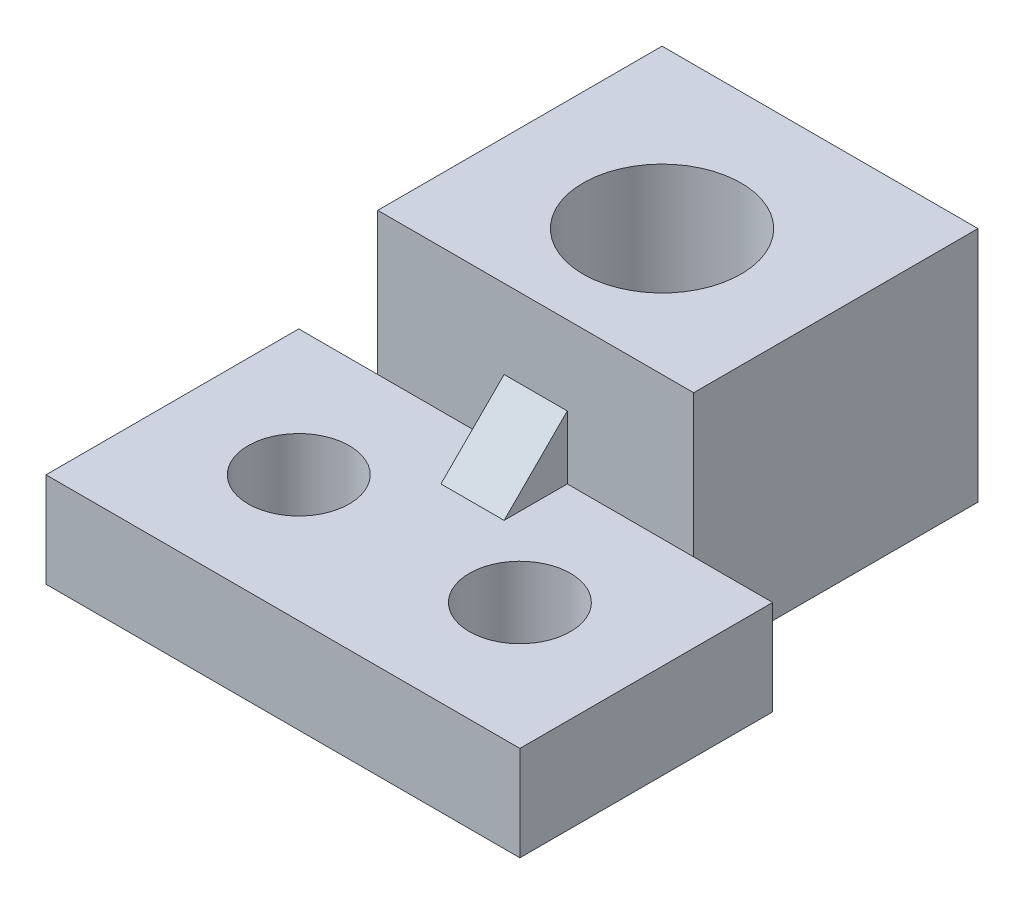
ISO-10303-21;
HEADER;
FILE_DESCRIPTION(('STEP AP214'),'2;1');
FILE_NAME('part.step','',(''),(''),'','','');
FILE_SCHEMA(('AUTOMOTIVE_DESIGN { 1 0 10303 214 1 1 1 1 }'));
ENDSEC;
DATA;
#1=APPLICATION_CONTEXT('core data for automotive mechanical design processes');
#2=APPLICATION_PROTOCOL_DEFINITION('international standard','automotive_design',2000,#1);
#3=PRODUCT_CONTEXT('',#1,'mechanical');
#4=PRODUCT('Part','Part','',(#3));
#5=PRODUCT_RELATED_PRODUCT_CATEGORY('part','',(#4));
#6=PRODUCT_DEFINITION_FORMATION('','',#4);
#7=PRODUCT_DEFINITION_CONTEXT('part definition',#1,'design');
#8=PRODUCT_DEFINITION('design','',#6,#7);
#9=PRODUCT_DEFINITION_SHAPE('','',#8);
#10=(LENGTH_UNIT() NAMED_UNIT(*) SI_UNIT(.MILLI.,.METRE.));
#11=(NAMED_UNIT(*) PLANE_ANGLE_UNIT() SI_UNIT($,.RADIAN.));
#12=(NAMED_UNIT(*) SI_UNIT($,.STERADIAN.) SOLID_ANGLE_UNIT());
#13=UNCERTAINTY_MEASURE_WITH_UNIT(LENGTH_MEASURE(1.E-05),#10,'distance_accuracy_value','');
#14=(GEOMETRIC_REPRESENTATION_CONTEXT(3) GLOBAL_UNCERTAINTY_ASSIGNED_CONTEXT((#13)) GLOBAL_UNIT_ASSIGNED_CONTEXT((#10,
#11,#12)) REPRESENTATION_CONTEXT('',''));
#15=CARTESIAN_POINT('',(0.,0.,0.));
#16=DIRECTION('',(0.,0.,1.));
#17=DIRECTION('',(1.,0.,0.));
#18=AXIS2_PLACEMENT_3D('',#15,#16,#17);
#19=CARTESIAN_POINT('',(0.,3.,0.));
#20=DIRECTION('',(0.,1.,0.));
#21=DIRECTION('',(0.,0.,1.));
#22=AXIS2_PLACEMENT_3D('',#19,#20,#21);
#23=PLANE('',#22);
#24=CARTESIAN_POINT('',(-3.5,3.,1.08489669975046));
#25=DIRECTION('',(0.,1.,0.));
#26=DIRECTION('',(0.,0.,1.));
#27=AXIS2_PLACEMENT_3D('',#24,#25,#26);
#28=CIRCLE('',#27,1.6);
#29=CARTESIAN_POINT('',(-3.5,3.,2.68489669975046));
#30=VERTEX_POINT('',#29);
#31=EDGE_CURVE('E184',#30,#30,#28,.T.);
#32=ORIENTED_EDGE('',*,*,#31,.F.);
#33=EDGE_LOOP('',(#32));
#34=FACE_BOUND('',#33,.T.);
#35=CARTESIAN_POINT('',(3.5,3.,1.08489669975046));
#36=DIRECTION('',(0.,1.,0.));
#37=DIRECTION('',(0.,0.,1.));
#38=AXIS2_PLACEMENT_3D('',#35,#36,#37);
#39=CIRCLE('',#38,1.6);
#40=CARTESIAN_POINT('',(3.5,3.,2.68489669975046));
#41=VERTEX_POINT('',#40);
#42=EDGE_CURVE('E178',#41,#41,#39,.T.);
#43=ORIENTED_EDGE('',*,*,#42,.F.);
#44=EDGE_LOOP('',(#43));
#45=FACE_BOUND('',#44,.T.);
#46=DIRECTION('',(-1.,0.,0.));
#47=VECTOR('',#46,1.);
#48=CARTESIAN_POINT('',(-7.5,3.,-2.91510330024954));
#49=LINE('',#48,#47);
#50=CARTESIAN_POINT('',(5.,3.,-2.91510330024954));
#51=VERTEX_POINT('',#50);
#52=CARTESIAN_POINT('',(1.,3.,-2.91510330024954));
#53=VERTEX_POINT('',#52);
#54=EDGE_CURVE('E203',#51,#53,#49,.T.);
#55=ORIENTED_EDGE('',*,*,#54,.T.);
#56=DIRECTION('',(0.,0.,-1.));
#57=VECTOR('',#56,1.);
#58=CARTESIAN_POINT('',(1.,3.,-0.915103300249544));
#59=LINE('',#58,#57);
#60=CARTESIAN_POINT('',(1.,3.,-0.915103300249544));
#61=VERTEX_POINT('',#60);
#62=EDGE_CURVE('E131',#61,#53,#59,.T.);
#63=ORIENTED_EDGE('',*,*,#62,.F.);
#64=DIRECTION('',(-1.,0.,0.));
#65=VECTOR('',#64,1.);
#66=CARTESIAN_POINT('',(1.,3.,-0.915103300249544));
#67=LINE('',#66,#65);
#68=CARTESIAN_POINT('',(-1.,3.,-0.915103300249544));
#69=VERTEX_POINT('',#68);
#70=EDGE_CURVE('E128',#61,#69,#67,.T.);
#71=ORIENTED_EDGE('',*,*,#70,.T.);
#72=DIRECTION('',(0.,0.,-1.));
#73=VECTOR('',#72,1.);
#74=CARTESIAN_POINT('',(-1.,3.,-0.915103300249544));
#75=LINE('',#74,#73);
#76=CARTESIAN_POINT('',(-1.,3.,-2.91510330024954));
#77=VERTEX_POINT('',#76);
#78=EDGE_CURVE('E138',#69,#77,#75,.T.);
#79=ORIENTED_EDGE('',*,*,#78,.T.);
#80=CARTESIAN_POINT('',(-5.,3.,-2.91510330024954));
#81=VERTEX_POINT('',#80);
#82=EDGE_CURVE('E204',#77,#81,#49,.T.);
#83=ORIENTED_EDGE('',*,*,#82,.T.);
#84=CARTESIAN_POINT('',(-7.5,3.,-2.91510330024954));
#85=VERTEX_POINT('',#84);
#86=EDGE_CURVE('E198',#81,#85,#49,.T.);
#87=ORIENTED_EDGE('',*,*,#86,.T.);
#88=DIRECTION('',(0.,0.,1.));
#89=VECTOR('',#88,1.);
#90=CARTESIAN_POINT('',(-7.5,3.,-2.91510330024954));
#91=LINE('',#90,#89);
#92=CARTESIAN_POINT('',(-7.5,3.,5.08489669975046));
#93=VERTEX_POINT('',#92);
#94=EDGE_CURVE('E190',#85,#93,#91,.T.);
#95=ORIENTED_EDGE('',*,*,#94,.T.);
#96=DIRECTION('',(1.,0.,0.));
#97=VECTOR('',#96,1.);
#98=CARTESIAN_POINT('',(-7.5,3.,5.08489669975046));
#99=LINE('',#98,#97);
#100=CARTESIAN_POINT('',(7.5,3.,5.08489669975046));
#101=VERTEX_POINT('',#100);
#102=EDGE_CURVE('E193',#93,#101,#99,.T.);
#103=ORIENTED_EDGE('',*,*,#102,.T.);
#104=DIRECTION('',(0.,0.,-1.));
#105=VECTOR('',#104,1.);
#106=CARTESIAN_POINT('',(7.5,3.,-2.91510330024954));
#107=LINE('',#106,#105);
#108=CARTESIAN_POINT('',(7.5,3.,-2.91510330024954));
#109=VERTEX_POINT('',#108);
#110=EDGE_CURVE('E196',#101,#109,#107,.T.);
#111=ORIENTED_EDGE('',*,*,#110,.T.);
#112=EDGE_CURVE('E199',#109,#51,#49,.T.);
#113=ORIENTED_EDGE('',*,*,#112,.T.);
#114=EDGE_LOOP('',(#55,#63,#71,#79,#83,#87,#95,#103,#111,#113));
#115=FACE_BOUND('',#114,.T.);
#116=ADVANCED_FACE('F33',(#34,#45,#115),#23,.T.);
#117=CARTESIAN_POINT('',(-5.,7.5,-2.91510330024954));
#118=DIRECTION('',(0.,0.,-1.));
#119=DIRECTION('',(-1.,0.,0.));
#120=AXIS2_PLACEMENT_3D('',#117,#118,#119);
#121=PLANE('',#120);
#122=DIRECTION('',(0.,1.,0.));
#123=VECTOR('',#122,1.);
#124=CARTESIAN_POINT('',(1.,3.,-2.91510330024954));
#125=LINE('',#124,#123);
#126=CARTESIAN_POINT('',(1.,5.,-2.91510330024954));
#127=VERTEX_POINT('',#126);
#128=EDGE_CURVE('E132',#53,#127,#125,.T.);
#129=ORIENTED_EDGE('',*,*,#128,.F.);
#130=ORIENTED_EDGE('',*,*,#54,.F.);
#131=DIRECTION('',(0.,-1.,0.));
#132=VECTOR('',#131,1.);
#133=CARTESIAN_POINT('',(5.,7.5,-2.91510330024954));
#134=LINE('',#133,#132);
#135=CARTESIAN_POINT('',(5.,7.5,-2.91510330024954));
#136=VERTEX_POINT('',#135);
#137=EDGE_CURVE('E44',#136,#51,#134,.T.);
#138=ORIENTED_EDGE('',*,*,#137,.F.);
#139=DIRECTION('',(1.,0.,0.));
#140=VECTOR('',#139,1.);
#141=CARTESIAN_POINT('',(-5.,7.5,-2.91510330024954));
#142=LINE('',#141,#140);
#143=CARTESIAN_POINT('',(-5.,7.5,-2.91510330024954));
#144=VERTEX_POINT('',#143);
#145=EDGE_CURVE('E157',#144,#136,#142,.T.);
#146=ORIENTED_EDGE('',*,*,#145,.F.);
#147=DIRECTION('',(0.,-1.,0.));
#148=VECTOR('',#147,1.);
#149=CARTESIAN_POINT('',(-5.,7.5,-2.91510330024954));
#150=LINE('',#149,#148);
#151=EDGE_CURVE('E174',#144,#81,#150,.T.);
#152=ORIENTED_EDGE('',*,*,#151,.T.);
#153=ORIENTED_EDGE('',*,*,#82,.F.);
#154=DIRECTION('',(0.,1.,0.));
#155=VECTOR('',#154,1.);
#156=CARTESIAN_POINT('',(-1.,3.,-2.91510330024954));
#157=LINE('',#156,#155);
#158=CARTESIAN_POINT('',(-1.,5.,-2.91510330024954));
#159=VERTEX_POINT('',#158);
#160=EDGE_CURVE('E143',#77,#159,#157,.T.);
#161=ORIENTED_EDGE('',*,*,#160,.T.);
#162=DIRECTION('',(-1.,0.,0.));
#163=VECTOR('',#162,1.);
#164=CARTESIAN_POINT('',(1.,5.,-2.91510330024954));
#165=LINE('',#164,#163);
#166=EDGE_CURVE('E51',#127,#159,#165,.T.);
#167=ORIENTED_EDGE('',*,*,#166,.F.);
#168=EDGE_LOOP('',(#129,#130,#138,#146,#152,#153,#161,#167));
#169=FACE_BOUND('',#168,.T.);
#170=ADVANCED_FACE('F141',(#169),#121,.F.);
#171=CARTESIAN_POINT('',(-7.5,3.,-2.91510330024954));
#172=DIRECTION('',(0.,0.,1.));
#173=DIRECTION('',(1.,0.,0.));
#174=AXIS2_PLACEMENT_3D('',#171,#172,#173);
#175=PLANE('',#174);
#176=CARTESIAN_POINT('',(5.,0.,-2.91510330024954));
#177=VERTEX_POINT('',#176);
#178=EDGE_CURVE('E11',#51,#177,#134,.T.);
#179=ORIENTED_EDGE('',*,*,#178,.F.);
#180=ORIENTED_EDGE('',*,*,#112,.F.);
#181=DIRECTION('',(0.,-1.,0.));
#182=VECTOR('',#181,1.);
#183=CARTESIAN_POINT('',(7.5,3.,-2.91510330024954));
#184=LINE('',#183,#182);
#185=CARTESIAN_POINT('',(7.5,0.,-2.91510330024954));
#186=VERTEX_POINT('',#185);
#187=EDGE_CURVE('E216',#109,#186,#184,.T.);
#188=ORIENTED_EDGE('',*,*,#187,.T.);
#189=DIRECTION('',(-1.,0.,0.));
#190=VECTOR('',#189,1.);
#191=CARTESIAN_POINT('',(-7.5,0.,-2.91510330024954));
#192=LINE('',#191,#190);
#193=EDGE_CURVE('E194',#186,#177,#192,.T.);
#194=ORIENTED_EDGE('',*,*,#193,.T.);
#195=EDGE_LOOP('',(#179,#180,#188,#194));
#196=FACE_BOUND('',#195,.T.);
#197=ADVANCED_FACE('F251',(#196),#175,.F.);
#198=CARTESIAN_POINT('',(0.,0.,0.));
#199=DIRECTION('',(0.,1.,0.));
#200=DIRECTION('',(0.,0.,1.));
#201=AXIS2_PLACEMENT_3D('',#198,#199,#200);
#202=PLANE('',#201);
#203=DIRECTION('',(0.,0.,1.));
#204=VECTOR('',#203,1.);
#205=CARTESIAN_POINT('',(-7.5,0.,-2.91510330024954));
#206=LINE('',#205,#204);
#207=CARTESIAN_POINT('',(-7.5,0.,-2.91510330024954));
#208=VERTEX_POINT('',#207);
#209=CARTESIAN_POINT('',(-7.5,0.,5.08489669975046));
#210=VERTEX_POINT('',#209);
#211=EDGE_CURVE('E187',#208,#210,#206,.T.);
#212=ORIENTED_EDGE('',*,*,#211,.F.);
#213=CARTESIAN_POINT('',(-5.,0.,-2.91510330024954));
#214=VERTEX_POINT('',#213);
#215=EDGE_CURVE('E211',#214,#208,#192,.T.);
#216=ORIENTED_EDGE('',*,*,#215,.F.);
#217=DIRECTION('',(0.,0.,1.));
#218=VECTOR('',#217,1.);
#219=CARTESIAN_POINT('',(-5.,0.,-2.91510330024954));
#220=LINE('',#219,#218);
#221=CARTESIAN_POINT('',(-5.,0.,-11.9151033002495));
#222=VERTEX_POINT('',#221);
#223=EDGE_CURVE('E59',#222,#214,#220,.T.);
#224=ORIENTED_EDGE('',*,*,#223,.F.);
#225=DIRECTION('',(-1.,0.,0.));
#226=VECTOR('',#225,1.);
#227=CARTESIAN_POINT('',(-5.,0.,-11.9151033002495));
#228=LINE('',#227,#226);
#229=CARTESIAN_POINT('',(5.,0.,-11.9151033002495));
#230=VERTEX_POINT('',#229);
#231=EDGE_CURVE('E158',#230,#222,#228,.T.);
#232=ORIENTED_EDGE('',*,*,#231,.F.);
#233=DIRECTION('',(0.,0.,-1.));
#234=VECTOR('',#233,1.);
#235=CARTESIAN_POINT('',(5.,0.,-2.91510330024954));
#236=LINE('',#235,#234);
#237=EDGE_CURVE('E166',#177,#230,#236,.T.);
#238=ORIENTED_EDGE('',*,*,#237,.F.);
#239=ORIENTED_EDGE('',*,*,#193,.F.);
#240=DIRECTION('',(0.,0.,-1.));
#241=VECTOR('',#240,1.);
#242=CARTESIAN_POINT('',(7.5,0.,-2.91510330024954));
#243=LINE('',#242,#241);
#244=CARTESIAN_POINT('',(7.5,0.,5.08489669975046));
#245=VERTEX_POINT('',#244);
#246=EDGE_CURVE('E209',#245,#186,#243,.T.);
#247=ORIENTED_EDGE('',*,*,#246,.F.);
#248=DIRECTION('',(1.,0.,0.));
#249=VECTOR('',#248,1.);
#250=CARTESIAN_POINT('',(-7.5,0.,5.08489669975046));
#251=LINE('',#250,#249);
#252=EDGE_CURVE('E207',#210,#245,#251,.T.);
#253=ORIENTED_EDGE('',*,*,#252,.F.);
#254=EDGE_LOOP('',(#212,#216,#224,#232,#238,#239,#247,#253));
#255=FACE_BOUND('',#254,.T.);
#256=CARTESIAN_POINT('',(-3.5,0.,1.08489669975046));
#257=DIRECTION('',(0.,1.,0.));
#258=DIRECTION('',(0.,0.,1.));
#259=AXIS2_PLACEMENT_3D('',#256,#257,#258);
#260=CIRCLE('',#259,1.6);
#261=CARTESIAN_POINT('',(-3.5,0.,2.68489669975046));
#262=VERTEX_POINT('',#261);
#263=EDGE_CURVE('E181',#262,#262,#260,.T.);
#264=ORIENTED_EDGE('',*,*,#263,.T.);
#265=EDGE_LOOP('',(#264));
#266=FACE_BOUND('',#265,.T.);
#267=CARTESIAN_POINT('',(3.5,0.,1.08489669975046));
#268=DIRECTION('',(0.,1.,0.));
#269=DIRECTION('',(0.,0.,1.));
#270=AXIS2_PLACEMENT_3D('',#267,#268,#269);
#271=CIRCLE('',#270,1.6);
#272=CARTESIAN_POINT('',(3.5,0.,2.68489669975046));
#273=VERTEX_POINT('',#272);
#274=EDGE_CURVE('E177',#273,#273,#271,.T.);
#275=ORIENTED_EDGE('',*,*,#274,.T.);
#276=EDGE_LOOP('',(#275));
#277=FACE_BOUND('',#276,.T.);
#278=CARTESIAN_POINT('',(0.,0.,-6.91510330024954));
#279=DIRECTION('',(0.,1.,0.));
#280=DIRECTION('',(0.,0.,1.));
#281=AXIS2_PLACEMENT_3D('',#278,#279,#280);
#282=CIRCLE('',#281,2.5);
#283=CARTESIAN_POINT('',(0.,0.,-4.41510330024954));
#284=VERTEX_POINT('',#283);
#285=EDGE_CURVE('E144',#284,#284,#282,.T.);
#286=ORIENTED_EDGE('',*,*,#285,.T.);
#287=EDGE_LOOP('',(#286));
#288=FACE_BOUND('',#287,.T.);
#289=ADVANCED_FACE('F235',(#255,#266,#277,#288),#202,.F.);
#290=CARTESIAN_POINT('',(-7.5,3.,-2.91510330024954));
#291=DIRECTION('',(1.,0.,0.));
#292=DIRECTION('',(0.,0.,-1.));
#293=AXIS2_PLACEMENT_3D('',#290,#291,#292);
#294=PLANE('',#293);
#295=ORIENTED_EDGE('',*,*,#211,.T.);
#296=DIRECTION('',(0.,-1.,0.));
#297=VECTOR('',#296,1.);
#298=CARTESIAN_POINT('',(-7.5,3.,5.08489669975046));
#299=LINE('',#298,#297);
#300=EDGE_CURVE('E37',#93,#210,#299,.T.);
#301=ORIENTED_EDGE('',*,*,#300,.F.);
#302=ORIENTED_EDGE('',*,*,#94,.F.);
#303=DIRECTION('',(0.,-1.,0.));
#304=VECTOR('',#303,1.);
#305=CARTESIAN_POINT('',(-7.5,3.,-2.91510330024954));
#306=LINE('',#305,#304);
#307=EDGE_CURVE('E202',#85,#208,#306,.T.);
#308=ORIENTED_EDGE('',*,*,#307,.T.);
#309=EDGE_LOOP('',(#295,#301,#302,#308));
#310=FACE_BOUND('',#309,.T.);
#311=ADVANCED_FACE('F35',(#310),#294,.F.);
#312=CARTESIAN_POINT('',(-7.5,3.,5.08489669975046));
#313=DIRECTION('',(0.,0.,-1.));
#314=DIRECTION('',(-1.,0.,0.));
#315=AXIS2_PLACEMENT_3D('',#312,#313,#314);
#316=PLANE('',#315);
#317=ORIENTED_EDGE('',*,*,#252,.T.);
#318=DIRECTION('',(0.,-1.,0.));
#319=VECTOR('',#318,1.);
#320=CARTESIAN_POINT('',(7.5,3.,5.08489669975046));
#321=LINE('',#320,#319);
#322=EDGE_CURVE('E218',#101,#245,#321,.T.);
#323=ORIENTED_EDGE('',*,*,#322,.F.);
#324=ORIENTED_EDGE('',*,*,#102,.F.);
#325=ORIENTED_EDGE('',*,*,#300,.T.);
#326=EDGE_LOOP('',(#317,#323,#324,#325));
#327=FACE_BOUND('',#326,.T.);
#328=ADVANCED_FACE('F291',(#327),#316,.F.);
#329=CARTESIAN_POINT('',(7.5,3.,-2.91510330024954));
#330=DIRECTION('',(-1.,0.,0.));
#331=DIRECTION('',(0.,0.,1.));
#332=AXIS2_PLACEMENT_3D('',#329,#330,#331);
#333=PLANE('',#332);
#334=ORIENTED_EDGE('',*,*,#246,.T.);
#335=ORIENTED_EDGE('',*,*,#187,.F.);
#336=ORIENTED_EDGE('',*,*,#110,.F.);
#337=ORIENTED_EDGE('',*,*,#322,.T.);
#338=EDGE_LOOP('',(#334,#335,#336,#337));
#339=FACE_BOUND('',#338,.T.);
#340=ADVANCED_FACE('F289',(#339),#333,.F.);
#341=ORIENTED_EDGE('',*,*,#86,.F.);
#342=EDGE_CURVE('E42',#81,#214,#150,.T.);
#343=ORIENTED_EDGE('',*,*,#342,.T.);
#344=ORIENTED_EDGE('',*,*,#215,.T.);
#345=ORIENTED_EDGE('',*,*,#307,.F.);
#346=EDGE_LOOP('',(#341,#343,#344,#345));
#347=FACE_BOUND('',#346,.T.);
#348=ADVANCED_FACE('F230',(#347),#175,.F.);
#349=CARTESIAN_POINT('',(-3.5,3.,1.08489669975046));
#350=DIRECTION('',(0.,-1.,0.));
#351=DIRECTION('',(0.,0.,-1.));
#352=AXIS2_PLACEMENT_3D('',#349,#350,#351);
#353=CYLINDRICAL_SURFACE('',#352,1.6);
#354=ORIENTED_EDGE('',*,*,#31,.T.);
#355=EDGE_LOOP('',(#354));
#356=FACE_BOUND('',#355,.T.);
#357=ORIENTED_EDGE('',*,*,#263,.F.);
#358=EDGE_LOOP('',(#357));
#359=FACE_BOUND('',#358,.T.);
#360=ADVANCED_FACE('F284',(#356,#359),#353,.F.);
#361=CARTESIAN_POINT('',(3.5,3.,1.08489669975046));
#362=DIRECTION('',(0.,-1.,0.));
#363=DIRECTION('',(0.,0.,-1.));
#364=AXIS2_PLACEMENT_3D('',#361,#362,#363);
#365=CYLINDRICAL_SURFACE('',#364,1.6);
#366=ORIENTED_EDGE('',*,*,#42,.T.);
#367=EDGE_LOOP('',(#366));
#368=FACE_BOUND('',#367,.T.);
#369=ORIENTED_EDGE('',*,*,#274,.F.);
#370=EDGE_LOOP('',(#369));
#371=FACE_BOUND('',#370,.T.);
#372=ADVANCED_FACE('F270',(#368,#371),#365,.F.);
#373=CARTESIAN_POINT('',(0.,7.5,0.));
#374=DIRECTION('',(0.,-1.,0.));
#375=DIRECTION('',(0.,0.,-1.));
#376=AXIS2_PLACEMENT_3D('',#373,#374,#375);
#377=PLANE('',#376);
#378=DIRECTION('',(0.,0.,1.));
#379=VECTOR('',#378,1.);
#380=CARTESIAN_POINT('',(-5.,7.5,-2.91510330024954));
#381=LINE('',#380,#379);
#382=CARTESIAN_POINT('',(-5.,7.5,-11.9151033002495));
#383=VERTEX_POINT('',#382);
#384=EDGE_CURVE('E154',#383,#144,#381,.T.);
#385=ORIENTED_EDGE('',*,*,#384,.T.);
#386=ORIENTED_EDGE('',*,*,#145,.T.);
#387=DIRECTION('',(0.,0.,-1.));
#388=VECTOR('',#387,1.);
#389=CARTESIAN_POINT('',(5.,7.5,-2.91510330024954));
#390=LINE('',#389,#388);
#391=CARTESIAN_POINT('',(5.,7.5,-11.9151033002495));
#392=VERTEX_POINT('',#391);
#393=EDGE_CURVE('E160',#136,#392,#390,.T.);
#394=ORIENTED_EDGE('',*,*,#393,.T.);
#395=DIRECTION('',(-1.,0.,0.));
#396=VECTOR('',#395,1.);
#397=CARTESIAN_POINT('',(-5.,7.5,-11.9151033002495));
#398=LINE('',#397,#396);
#399=EDGE_CURVE('E162',#392,#383,#398,.T.);
#400=ORIENTED_EDGE('',*,*,#399,.T.);
#401=EDGE_LOOP('',(#385,#386,#394,#400));
#402=FACE_BOUND('',#401,.T.);
#403=CARTESIAN_POINT('',(0.,7.5,-6.91510330024954));
#404=DIRECTION('',(0.,1.,0.));
#405=DIRECTION('',(0.,0.,1.));
#406=AXIS2_PLACEMENT_3D('',#403,#404,#405);
#407=CIRCLE('',#406,2.5);
#408=CARTESIAN_POINT('',(0.,7.5,-4.41510330024954));
#409=VERTEX_POINT('',#408);
#410=EDGE_CURVE('E147',#409,#409,#407,.T.);
#411=ORIENTED_EDGE('',*,*,#410,.F.);
#412=EDGE_LOOP('',(#411));
#413=FACE_BOUND('',#412,.T.);
#414=ADVANCED_FACE('F260',(#402,#413),#377,.F.);
#415=CARTESIAN_POINT('',(-5.,7.5,-2.91510330024954));
#416=DIRECTION('',(1.,0.,0.));
#417=DIRECTION('',(0.,0.,-1.));
#418=AXIS2_PLACEMENT_3D('',#415,#416,#417);
#419=PLANE('',#418);
#420=ORIENTED_EDGE('',*,*,#223,.T.);
#421=ORIENTED_EDGE('',*,*,#342,.F.);
#422=ORIENTED_EDGE('',*,*,#151,.F.);
#423=ORIENTED_EDGE('',*,*,#384,.F.);
#424=DIRECTION('',(0.,-1.,0.));
#425=VECTOR('',#424,1.);
#426=CARTESIAN_POINT('',(-5.,7.5,-11.9151033002495));
#427=LINE('',#426,#425);
#428=EDGE_CURVE('E164',#383,#222,#427,.T.);
#429=ORIENTED_EDGE('',*,*,#428,.T.);
#430=EDGE_LOOP('',(#420,#421,#422,#423,#429));
#431=FACE_BOUND('',#430,.T.);
#432=ADVANCED_FACE('F262',(#431),#419,.F.);
#433=CARTESIAN_POINT('',(5.,7.5,-2.91510330024954));
#434=DIRECTION('',(-1.,0.,0.));
#435=DIRECTION('',(0.,0.,1.));
#436=AXIS2_PLACEMENT_3D('',#433,#434,#435);
#437=PLANE('',#436);
#438=ORIENTED_EDGE('',*,*,#237,.T.);
#439=DIRECTION('',(0.,-1.,0.));
#440=VECTOR('',#439,1.);
#441=CARTESIAN_POINT('',(5.,7.5,-11.9151033002495));
#442=LINE('',#441,#440);
#443=EDGE_CURVE('E170',#392,#230,#442,.T.);
#444=ORIENTED_EDGE('',*,*,#443,.F.);
#445=ORIENTED_EDGE('',*,*,#393,.F.);
#446=ORIENTED_EDGE('',*,*,#137,.T.);
#447=ORIENTED_EDGE('',*,*,#178,.T.);
#448=EDGE_LOOP('',(#438,#444,#445,#446,#447));
#449=FACE_BOUND('',#448,.T.);
#450=ADVANCED_FACE('F247',(#449),#437,.F.);
#451=CARTESIAN_POINT('',(-5.,7.5,-11.9151033002495));
#452=DIRECTION('',(0.,0.,1.));
#453=DIRECTION('',(1.,0.,0.));
#454=AXIS2_PLACEMENT_3D('',#451,#452,#453);
#455=PLANE('',#454);
#456=ORIENTED_EDGE('',*,*,#231,.T.);
#457=ORIENTED_EDGE('',*,*,#428,.F.);
#458=ORIENTED_EDGE('',*,*,#399,.F.);
#459=ORIENTED_EDGE('',*,*,#443,.T.);
#460=EDGE_LOOP('',(#456,#457,#458,#459));
#461=FACE_BOUND('',#460,.T.);
#462=ADVANCED_FACE('F256',(#461),#455,.F.);
#463=CARTESIAN_POINT('',(0.,7.5,-6.91510330024954));
#464=DIRECTION('',(0.,-1.,0.));
#465=DIRECTION('',(0.,0.,-1.));
#466=AXIS2_PLACEMENT_3D('',#463,#464,#465);
#467=CYLINDRICAL_SURFACE('',#466,2.5);
#468=ORIENTED_EDGE('',*,*,#410,.T.);
#469=EDGE_LOOP('',(#468));
#470=FACE_BOUND('',#469,.T.);
#471=ORIENTED_EDGE('',*,*,#285,.F.);
#472=EDGE_LOOP('',(#471));
#473=FACE_BOUND('',#472,.T.);
#474=ADVANCED_FACE('F326',(#470,#473),#467,.F.);
#475=CARTESIAN_POINT('',(1.,5.,-2.91510330024954));
#476=DIRECTION('',(0.,-0.707106781186547,-0.707106781186547));
#477=DIRECTION('',(0.,0.707106781186548,-0.707106781186548));
#478=AXIS2_PLACEMENT_3D('',#475,#476,#477);
#479=PLANE('',#478);
#480=DIRECTION('',(0.,-0.707106781186548,0.707106781186548));
#481=VECTOR('',#480,1.);
#482=CARTESIAN_POINT('',(-1.,5.,-2.91510330024954));
#483=LINE('',#482,#481);
#484=EDGE_CURVE('E429',#159,#69,#483,.T.);
#485=ORIENTED_EDGE('',*,*,#484,.T.);
#486=ORIENTED_EDGE('',*,*,#70,.F.);
#487=DIRECTION('',(0.,-0.707106781186548,0.707106781186548));
#488=VECTOR('',#487,1.);
#489=CARTESIAN_POINT('',(1.,5.,-2.91510330024954));
#490=LINE('',#489,#488);
#491=EDGE_CURVE('E124',#127,#61,#490,.T.);
#492=ORIENTED_EDGE('',*,*,#491,.F.);
#493=ORIENTED_EDGE('',*,*,#166,.T.);
#494=EDGE_LOOP('',(#485,#486,#492,#493));
#495=FACE_BOUND('',#494,.T.);
#496=ADVANCED_FACE('F126',(#495),#479,.F.);
#497=CARTESIAN_POINT('',(1.,0.,0.));
#498=DIRECTION('',(-1.,0.,0.));
#499=DIRECTION('',(0.,0.,1.));
#500=AXIS2_PLACEMENT_3D('',#497,#498,#499);
#501=PLANE('',#500);
#502=ORIENTED_EDGE('',*,*,#128,.T.);
#503=ORIENTED_EDGE('',*,*,#491,.T.);
#504=ORIENTED_EDGE('',*,*,#62,.T.);
#505=EDGE_LOOP('',(#502,#503,#504));
#506=FACE_BOUND('',#505,.T.);
#507=ADVANCED_FACE('F135',(#506),#501,.F.);
#508=CARTESIAN_POINT('',(-1.,0.,0.));
#509=DIRECTION('',(-1.,0.,0.));
#510=DIRECTION('',(0.,0.,1.));
#511=AXIS2_PLACEMENT_3D('',#508,#509,#510);
#512=PLANE('',#511);
#513=ORIENTED_EDGE('',*,*,#160,.F.);
#514=ORIENTED_EDGE('',*,*,#78,.F.);
#515=ORIENTED_EDGE('',*,*,#484,.F.);
#516=EDGE_LOOP('',(#513,#514,#515));
#517=FACE_BOUND('',#516,.T.);
#518=ADVANCED_FACE('F336',(#517),#512,.T.);
#519=CLOSED_SHELL('',(#116,#170,#197,#289,#311,#328,#340,#348,#360,#372,#414,#432,#450,#462,
#474,#496,#507,#518));
#520=MANIFOLD_SOLID_BREP('B2',#519);
#521=ADVANCED_BREP_SHAPE_REPRESENTATION('',(#18,#520),#14);
#522=SHAPE_DEFINITION_REPRESENTATION(#9,#521);
ENDSEC;
END-ISO-10303-21;
